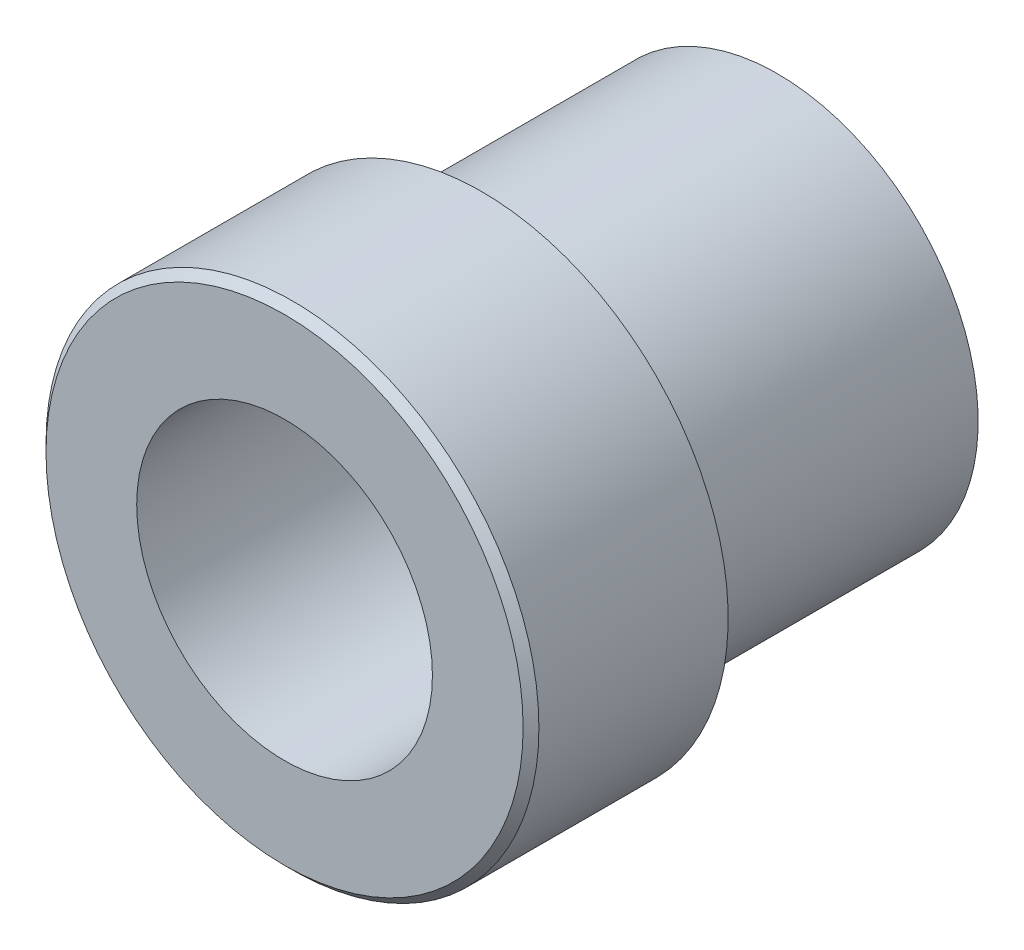
ISO-10303-21;
HEADER;
FILE_DESCRIPTION(('STEP AP214'),'2;1');
FILE_NAME('part.step','',(''),(''),'','','');
FILE_SCHEMA(('AUTOMOTIVE_DESIGN { 1 0 10303 214 1 1 1 1 }'));
ENDSEC;
DATA;
#1=APPLICATION_CONTEXT('core data for automotive mechanical design processes');
#2=APPLICATION_PROTOCOL_DEFINITION('international standard','automotive_design',2000,#1);
#3=PRODUCT_CONTEXT('',#1,'mechanical');
#4=PRODUCT('Part','Part','',(#3));
#5=PRODUCT_RELATED_PRODUCT_CATEGORY('part','',(#4));
#6=PRODUCT_DEFINITION_FORMATION('','',#4);
#7=PRODUCT_DEFINITION_CONTEXT('part definition',#1,'design');
#8=PRODUCT_DEFINITION('design','',#6,#7);
#9=PRODUCT_DEFINITION_SHAPE('','',#8);
#10=(LENGTH_UNIT() NAMED_UNIT(*) SI_UNIT(.MILLI.,.METRE.));
#11=(NAMED_UNIT(*) PLANE_ANGLE_UNIT() SI_UNIT($,.RADIAN.));
#12=(NAMED_UNIT(*) SI_UNIT($,.STERADIAN.) SOLID_ANGLE_UNIT());
#13=UNCERTAINTY_MEASURE_WITH_UNIT(LENGTH_MEASURE(1.E-05),#10,'distance_accuracy_value','');
#14=(GEOMETRIC_REPRESENTATION_CONTEXT(3) GLOBAL_UNCERTAINTY_ASSIGNED_CONTEXT((#13)) GLOBAL_UNIT_ASSIGNED_CONTEXT((#10,
#11,#12)) REPRESENTATION_CONTEXT('',''));
#15=CARTESIAN_POINT('',(0.,0.,0.));
#16=DIRECTION('',(0.,0.,1.));
#17=DIRECTION('',(1.,0.,0.));
#18=AXIS2_PLACEMENT_3D('',#15,#16,#17);
#19=CARTESIAN_POINT('',(0.,0.,15.875));
#20=DIRECTION('',(0.,0.,-1.));
#21=DIRECTION('',(-1.,0.,0.));
#22=AXIS2_PLACEMENT_3D('',#19,#20,#21);
#23=CYLINDRICAL_SURFACE('',#22,7.9375);
#24=CARTESIAN_POINT('',(0.,0.,15.621));
#25=DIRECTION('',(0.,0.,1.));
#26=DIRECTION('',(1.,0.,0.));
#27=AXIS2_PLACEMENT_3D('',#24,#25,#26);
#28=CIRCLE('',#27,7.9375);
#29=CARTESIAN_POINT('',(7.9375,0.,15.621));
#30=VERTEX_POINT('',#29);
#31=EDGE_CURVE('E11',#30,#30,#28,.F.);
#32=ORIENTED_EDGE('',*,*,#31,.T.);
#33=EDGE_LOOP('',(#32));
#34=FACE_BOUND('',#33,.T.);
#35=CARTESIAN_POINT('',(0.,0.,9.525));
#36=DIRECTION('',(0.,0.,-1.));
#37=DIRECTION('',(-1.,0.,0.));
#38=AXIS2_PLACEMENT_3D('',#35,#36,#37);
#39=CIRCLE('',#38,7.9375);
#40=CARTESIAN_POINT('',(-7.9375,0.,9.525));
#41=VERTEX_POINT('',#40);
#42=EDGE_CURVE('E40',#41,#41,#39,.T.);
#43=ORIENTED_EDGE('',*,*,#42,.F.);
#44=EDGE_LOOP('',(#43));
#45=FACE_BOUND('',#44,.T.);
#46=ADVANCED_FACE('F36',(#34,#45),#23,.T.);
#47=CARTESIAN_POINT('',(0.,0.,15.875));
#48=DIRECTION('',(0.,0.,1.));
#49=DIRECTION('',(1.,0.,0.));
#50=AXIS2_PLACEMENT_3D('',#47,#48,#49);
#51=PLANE('',#50);
#52=CARTESIAN_POINT('',(0.,0.,15.875));
#53=DIRECTION('',(0.,0.,1.));
#54=DIRECTION('',(1.,0.,0.));
#55=AXIS2_PLACEMENT_3D('',#52,#53,#54);
#56=CIRCLE('',#55,4.7625);
#57=CARTESIAN_POINT('',(4.7625,0.,15.875));
#58=VERTEX_POINT('',#57);
#59=EDGE_CURVE('E59',#58,#58,#56,.T.);
#60=ORIENTED_EDGE('',*,*,#59,.F.);
#61=EDGE_LOOP('',(#60));
#62=FACE_BOUND('',#61,.T.);
#63=CARTESIAN_POINT('',(0.,0.,15.875));
#64=DIRECTION('',(0.,0.,1.));
#65=DIRECTION('',(1.,0.,0.));
#66=AXIS2_PLACEMENT_3D('',#63,#64,#65);
#67=CIRCLE('',#66,7.6835);
#68=CARTESIAN_POINT('',(7.6835,0.,15.875));
#69=VERTEX_POINT('',#68);
#70=EDGE_CURVE('E44',#69,#69,#67,.T.);
#71=ORIENTED_EDGE('',*,*,#70,.T.);
#72=EDGE_LOOP('',(#71));
#73=FACE_BOUND('',#72,.T.);
#74=ADVANCED_FACE('F65',(#62,#73),#51,.T.);
#75=CARTESIAN_POINT('',(0.,0.,15.875));
#76=DIRECTION('',(0.,0.,-1.));
#77=DIRECTION('',(-1.,0.,0.));
#78=AXIS2_PLACEMENT_3D('',#75,#76,#77);
#79=CONICAL_SURFACE('',#78,7.6835,0.785398163397442);
#80=ORIENTED_EDGE('',*,*,#31,.F.);
#81=EDGE_LOOP('',(#80));
#82=FACE_BOUND('',#81,.T.);
#83=ORIENTED_EDGE('',*,*,#70,.F.);
#84=EDGE_LOOP('',(#83));
#85=FACE_BOUND('',#84,.T.);
#86=ADVANCED_FACE('F38',(#82,#85),#79,.T.);
#87=CARTESIAN_POINT('',(0.,0.,9.525));
#88=DIRECTION('',(0.,0.,-1.));
#89=DIRECTION('',(-1.,0.,0.));
#90=AXIS2_PLACEMENT_3D('',#87,#88,#89);
#91=PLANE('',#90);
#92=CARTESIAN_POINT('',(0.,0.,9.525));
#93=DIRECTION('',(0.,0.,-1.));
#94=DIRECTION('',(-1.,0.,0.));
#95=AXIS2_PLACEMENT_3D('',#92,#93,#94);
#96=CIRCLE('',#95,6.4643);
#97=CARTESIAN_POINT('',(-6.4643,0.,9.525));
#98=VERTEX_POINT('',#97);
#99=EDGE_CURVE('E53',#98,#98,#96,.T.);
#100=ORIENTED_EDGE('',*,*,#99,.F.);
#101=EDGE_LOOP('',(#100));
#102=FACE_BOUND('',#101,.T.);
#103=ORIENTED_EDGE('',*,*,#42,.T.);
#104=EDGE_LOOP('',(#103));
#105=FACE_BOUND('',#104,.T.);
#106=ADVANCED_FACE('F72',(#102,#105),#91,.T.);
#107=CARTESIAN_POINT('',(0.,0.,9.525));
#108=DIRECTION('',(0.,0.,-1.));
#109=DIRECTION('',(-1.,0.,0.));
#110=AXIS2_PLACEMENT_3D('',#107,#108,#109);
#111=CYLINDRICAL_SURFACE('',#110,6.4643);
#112=ORIENTED_EDGE('',*,*,#99,.T.);
#113=EDGE_LOOP('',(#112));
#114=FACE_BOUND('',#113,.T.);
#115=CARTESIAN_POINT('',(0.,0.,0.));
#116=DIRECTION('',(0.,0.,-1.));
#117=DIRECTION('',(-1.,0.,0.));
#118=AXIS2_PLACEMENT_3D('',#115,#116,#117);
#119=CIRCLE('',#118,6.4643);
#120=CARTESIAN_POINT('',(-6.4643,0.,0.));
#121=VERTEX_POINT('',#120);
#122=EDGE_CURVE('E50',#121,#121,#119,.T.);
#123=ORIENTED_EDGE('',*,*,#122,.F.);
#124=EDGE_LOOP('',(#123));
#125=FACE_BOUND('',#124,.T.);
#126=ADVANCED_FACE('F77',(#114,#125),#111,.T.);
#127=CARTESIAN_POINT('',(0.,0.,0.));
#128=DIRECTION('',(0.,0.,1.));
#129=DIRECTION('',(1.,0.,0.));
#130=AXIS2_PLACEMENT_3D('',#127,#128,#129);
#131=PLANE('',#130);
#132=CARTESIAN_POINT('',(0.,0.,0.));
#133=DIRECTION('',(0.,0.,1.));
#134=DIRECTION('',(1.,0.,0.));
#135=AXIS2_PLACEMENT_3D('',#132,#133,#134);
#136=CIRCLE('',#135,4.7625);
#137=CARTESIAN_POINT('',(4.7625,0.,0.));
#138=VERTEX_POINT('',#137);
#139=EDGE_CURVE('E54',#138,#138,#136,.T.);
#140=ORIENTED_EDGE('',*,*,#139,.T.);
#141=EDGE_LOOP('',(#140));
#142=FACE_BOUND('',#141,.T.);
#143=ORIENTED_EDGE('',*,*,#122,.T.);
#144=EDGE_LOOP('',(#143));
#145=FACE_BOUND('',#144,.T.);
#146=ADVANCED_FACE('F85',(#142,#145),#131,.F.);
#147=CARTESIAN_POINT('',(0.,0.,15.875));
#148=DIRECTION('',(0.,0.,1.));
#149=DIRECTION('',(1.,0.,0.));
#150=AXIS2_PLACEMENT_3D('',#147,#148,#149);
#151=CYLINDRICAL_SURFACE('',#150,4.7625);
#152=ORIENTED_EDGE('',*,*,#139,.F.);
#153=EDGE_LOOP('',(#152));
#154=FACE_BOUND('',#153,.T.);
#155=ORIENTED_EDGE('',*,*,#59,.T.);
#156=EDGE_LOOP('',(#155));
#157=FACE_BOUND('',#156,.T.);
#158=ADVANCED_FACE('F63',(#154,#157),#151,.F.);
#159=CLOSED_SHELL('',(#46,#74,#86,#106,#126,#146,#158));
#160=MANIFOLD_SOLID_BREP('B2',#159);
#161=ADVANCED_BREP_SHAPE_REPRESENTATION('',(#18,#160),#14);
#162=SHAPE_DEFINITION_REPRESENTATION(#9,#161);
ENDSEC;
END-ISO-10303-21;
